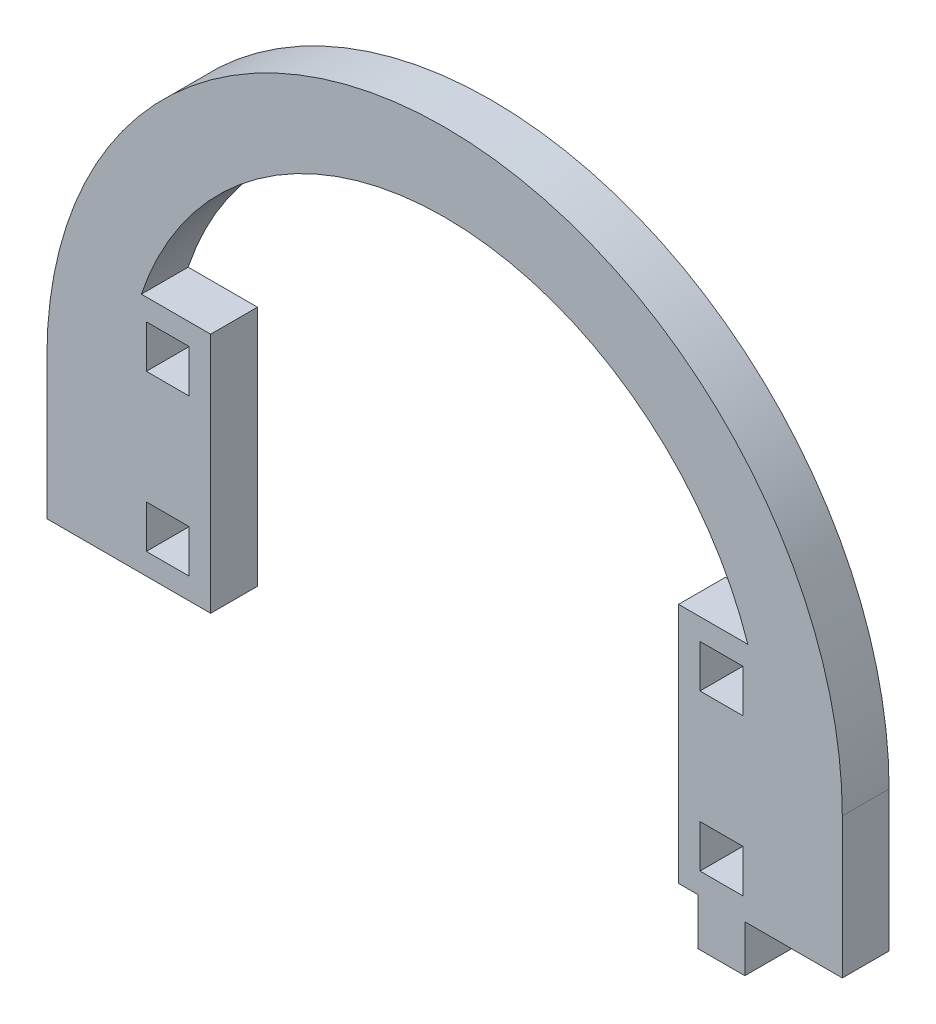
ISO-10303-21;
HEADER;
FILE_DESCRIPTION(('STEP AP214'),'2;1');
FILE_NAME('part.step','',(''),(''),'','','');
FILE_SCHEMA(('AUTOMOTIVE_DESIGN { 1 0 10303 214 1 1 1 1 }'));
ENDSEC;
DATA;
#1=APPLICATION_CONTEXT('core data for automotive mechanical design processes');
#2=APPLICATION_PROTOCOL_DEFINITION('international standard','automotive_design',2000,#1);
#3=PRODUCT_CONTEXT('',#1,'mechanical');
#4=PRODUCT('Part','Part','',(#3));
#5=PRODUCT_RELATED_PRODUCT_CATEGORY('part','',(#4));
#6=PRODUCT_DEFINITION_FORMATION('','',#4);
#7=PRODUCT_DEFINITION_CONTEXT('part definition',#1,'design');
#8=PRODUCT_DEFINITION('design','',#6,#7);
#9=PRODUCT_DEFINITION_SHAPE('','',#8);
#10=(LENGTH_UNIT() NAMED_UNIT(*) SI_UNIT(.MILLI.,.METRE.));
#11=(NAMED_UNIT(*) PLANE_ANGLE_UNIT() SI_UNIT($,.RADIAN.));
#12=(NAMED_UNIT(*) SI_UNIT($,.STERADIAN.) SOLID_ANGLE_UNIT());
#13=UNCERTAINTY_MEASURE_WITH_UNIT(LENGTH_MEASURE(1.E-05),#10,'distance_accuracy_value','');
#14=(GEOMETRIC_REPRESENTATION_CONTEXT(3) GLOBAL_UNCERTAINTY_ASSIGNED_CONTEXT((#13)) GLOBAL_UNIT_ASSIGNED_CONTEXT((#10,
#11,#12)) REPRESENTATION_CONTEXT('',''));
#15=CARTESIAN_POINT('',(0.,0.,0.));
#16=DIRECTION('',(0.,0.,1.));
#17=DIRECTION('',(1.,0.,0.));
#18=AXIS2_PLACEMENT_3D('',#15,#16,#17);
#19=CARTESIAN_POINT('',(3081.37046218599,1416.78891498135,6.));
#20=DIRECTION('',(0.,0.,1.));
#21=DIRECTION('',(1.,0.,0.));
#22=AXIS2_PLACEMENT_3D('',#19,#20,#21);
#23=PLANE('',#22);
#24=CARTESIAN_POINT('',(3081.37046218599,1416.78891498135,6.));
#25=DIRECTION('',(0.,0.,1.));
#26=DIRECTION('',(1.,0.,0.));
#27=AXIS2_PLACEMENT_3D('',#24,#25,#26);
#28=CIRCLE('',#27,50.9999999999999);
#29=CARTESIAN_POINT('',(3132.37046218599,1416.78891498135,6.));
#30=VERTEX_POINT('',#29);
#31=CARTESIAN_POINT('',(3030.37046218599,1416.78891498135,6.));
#32=VERTEX_POINT('',#31);
#33=EDGE_CURVE('E642',#30,#32,#28,.T.);
#34=ORIENTED_EDGE('',*,*,#33,.T.);
#35=DIRECTION('',(0.,-1.,0.));
#36=VECTOR('',#35,1.);
#37=CARTESIAN_POINT('',(3030.37046218599,1416.78891498135,6.));
#38=LINE('',#37,#36);
#39=CARTESIAN_POINT('',(3030.37046218599,1398.78891498135,6.));
#40=VERTEX_POINT('',#39);
#41=EDGE_CURVE('E646',#32,#40,#38,.T.);
#42=ORIENTED_EDGE('',*,*,#41,.T.);
#43=DIRECTION('',(-1.,0.,0.));
#44=VECTOR('',#43,1.);
#45=CARTESIAN_POINT('',(3040.37046218599,1398.78891498135,6.));
#46=LINE('',#45,#44);
#47=CARTESIAN_POINT('',(3051.37046218599,1398.78891498135,6.));
#48=VERTEX_POINT('',#47);
#49=EDGE_CURVE('E650',#48,#40,#46,.T.);
#50=ORIENTED_EDGE('',*,*,#49,.F.);
#51=DIRECTION('',(0.,-1.,0.));
#52=VECTOR('',#51,1.);
#53=CARTESIAN_POINT('',(3051.37046218599,1429.78891498135,6.));
#54=LINE('',#53,#52);
#55=CARTESIAN_POINT('',(3051.37046218599,1429.78891498135,6.));
#56=VERTEX_POINT('',#55);
#57=EDGE_CURVE('E654',#56,#48,#54,.T.);
#58=ORIENTED_EDGE('',*,*,#57,.F.);
#59=DIRECTION('',(-1.,0.,0.));
#60=VECTOR('',#59,1.);
#61=CARTESIAN_POINT('',(3051.37046218599,1429.78891498135,6.));
#62=LINE('',#61,#60);
#63=CARTESIAN_POINT('',(3042.48601799554,1429.78891498135,6.));
#64=VERTEX_POINT('',#63);
#65=EDGE_CURVE('E658',#56,#64,#62,.T.);
#66=ORIENTED_EDGE('',*,*,#65,.T.);
#67=CARTESIAN_POINT('',(3081.37046218599,1416.78891498135,6.));
#68=DIRECTION('',(0.,0.,1.));
#69=DIRECTION('',(1.,0.,0.));
#70=AXIS2_PLACEMENT_3D('',#67,#68,#69);
#71=CIRCLE('',#70,41.0000000000005);
#72=CARTESIAN_POINT('',(3120.25490637644,1429.78891498135,6.));
#73=VERTEX_POINT('',#72);
#74=EDGE_CURVE('E661',#73,#64,#71,.T.);
#75=ORIENTED_EDGE('',*,*,#74,.F.);
#76=DIRECTION('',(-1.,0.,0.));
#77=VECTOR('',#76,1.);
#78=CARTESIAN_POINT('',(3120.25490637644,1429.78891498135,6.));
#79=LINE('',#78,#77);
#80=CARTESIAN_POINT('',(3111.37046218599,1429.78891498135,6.));
#81=VERTEX_POINT('',#80);
#82=EDGE_CURVE('E665',#73,#81,#79,.T.);
#83=ORIENTED_EDGE('',*,*,#82,.T.);
#84=DIRECTION('',(0.,-1.,0.));
#85=VECTOR('',#84,1.);
#86=CARTESIAN_POINT('',(3111.37046218599,1429.78891498135,6.));
#87=LINE('',#86,#85);
#88=CARTESIAN_POINT('',(3111.37046218599,1398.78891498135,6.));
#89=VERTEX_POINT('',#88);
#90=EDGE_CURVE('E668',#81,#89,#87,.T.);
#91=ORIENTED_EDGE('',*,*,#90,.T.);
#92=DIRECTION('',(1.,0.,0.));
#93=VECTOR('',#92,1.);
#94=CARTESIAN_POINT('',(3111.37046218599,1398.78891498135,6.));
#95=LINE('',#94,#93);
#96=CARTESIAN_POINT('',(3113.87046218599,1398.78891498135,6.));
#97=VERTEX_POINT('',#96);
#98=EDGE_CURVE('E671',#89,#97,#95,.T.);
#99=ORIENTED_EDGE('',*,*,#98,.T.);
#100=DIRECTION('',(0.,-1.,0.));
#101=VECTOR('',#100,1.);
#102=CARTESIAN_POINT('',(3113.87046218599,1398.78891498135,6.));
#103=LINE('',#102,#101);
#104=CARTESIAN_POINT('',(3113.87046218599,1392.78891498135,6.));
#105=VERTEX_POINT('',#104);
#106=EDGE_CURVE('E674',#97,#105,#103,.T.);
#107=ORIENTED_EDGE('',*,*,#106,.T.);
#108=DIRECTION('',(1.,0.,0.));
#109=VECTOR('',#108,1.);
#110=CARTESIAN_POINT('',(3113.87046218599,1392.78891498135,6.));
#111=LINE('',#110,#109);
#112=CARTESIAN_POINT('',(3119.87046218599,1392.78891498135,6.));
#113=VERTEX_POINT('',#112);
#114=EDGE_CURVE('E677',#105,#113,#111,.T.);
#115=ORIENTED_EDGE('',*,*,#114,.T.);
#116=DIRECTION('',(0.,1.,0.));
#117=VECTOR('',#116,1.);
#118=CARTESIAN_POINT('',(3119.87046218599,1392.78891498135,6.));
#119=LINE('',#118,#117);
#120=CARTESIAN_POINT('',(3119.87046218599,1398.78891498135,6.));
#121=VERTEX_POINT('',#120);
#122=EDGE_CURVE('E680',#113,#121,#119,.T.);
#123=ORIENTED_EDGE('',*,*,#122,.T.);
#124=DIRECTION('',(1.,0.,0.));
#125=VECTOR('',#124,1.);
#126=CARTESIAN_POINT('',(3119.87046218599,1398.78891498135,6.));
#127=LINE('',#126,#125);
#128=CARTESIAN_POINT('',(3132.37046218599,1398.78891498135,6.));
#129=VERTEX_POINT('',#128);
#130=EDGE_CURVE('E683',#121,#129,#127,.T.);
#131=ORIENTED_EDGE('',*,*,#130,.T.);
#132=DIRECTION('',(0.,-1.,0.));
#133=VECTOR('',#132,1.);
#134=CARTESIAN_POINT('',(3132.37046218599,1416.78891498135,6.));
#135=LINE('',#134,#133);
#136=EDGE_CURVE('E686',#30,#129,#135,.T.);
#137=ORIENTED_EDGE('',*,*,#136,.F.);
#138=EDGE_LOOP('',(#34,#42,#50,#58,#66,#75,#83,#91,#99,#107,#115,#123,#131,#137));
#139=FACE_BOUND('',#138,.T.);
#140=DIRECTION('',(0.,1.,0.));
#141=VECTOR('',#140,1.);
#142=CARTESIAN_POINT('',(3048.62046218599,0.,6.));
#143=LINE('',#142,#141);
#144=CARTESIAN_POINT('',(3048.62046218599,1401.53891498135,6.));
#145=VERTEX_POINT('',#144);
#146=CARTESIAN_POINT('',(3048.62046218599,1407.03891498135,6.));
#147=VERTEX_POINT('',#146);
#148=EDGE_CURVE('E602',#145,#147,#143,.T.);
#149=ORIENTED_EDGE('',*,*,#148,.F.);
#150=DIRECTION('',(1.,0.,0.));
#151=VECTOR('',#150,1.);
#152=CARTESIAN_POINT('',(0.,1401.53891498135,6.));
#153=LINE('',#152,#151);
#154=CARTESIAN_POINT('',(3043.12046218599,1401.53891498135,6.));
#155=VERTEX_POINT('',#154);
#156=EDGE_CURVE('E599',#155,#145,#153,.T.);
#157=ORIENTED_EDGE('',*,*,#156,.F.);
#158=DIRECTION('',(0.,-1.,0.));
#159=VECTOR('',#158,1.);
#160=CARTESIAN_POINT('',(3043.12046218599,0.,6.));
#161=LINE('',#160,#159);
#162=CARTESIAN_POINT('',(3043.12046218599,1407.03891498135,6.));
#163=VERTEX_POINT('',#162);
#164=EDGE_CURVE('E610',#163,#155,#161,.T.);
#165=ORIENTED_EDGE('',*,*,#164,.F.);
#166=DIRECTION('',(-1.,0.,0.));
#167=VECTOR('',#166,1.);
#168=CARTESIAN_POINT('',(0.,1407.03891498135,6.));
#169=LINE('',#168,#167);
#170=EDGE_CURVE('E606',#147,#163,#169,.T.);
#171=ORIENTED_EDGE('',*,*,#170,.F.);
#172=EDGE_LOOP('',(#149,#157,#165,#171));
#173=FACE_BOUND('',#172,.T.);
#174=DIRECTION('',(0.,1.,0.));
#175=VECTOR('',#174,1.);
#176=CARTESIAN_POINT('',(3119.62046218599,0.,6.));
#177=LINE('',#176,#175);
#178=CARTESIAN_POINT('',(3119.62046218599,1421.53891498135,6.));
#179=VERTEX_POINT('',#178);
#180=CARTESIAN_POINT('',(3119.62046218599,1427.03891498135,6.));
#181=VERTEX_POINT('',#180);
#182=EDGE_CURVE('E559',#179,#181,#177,.T.);
#183=ORIENTED_EDGE('',*,*,#182,.F.);
#184=DIRECTION('',(1.,0.,0.));
#185=VECTOR('',#184,1.);
#186=CARTESIAN_POINT('',(0.,1421.53891498135,6.));
#187=LINE('',#186,#185);
#188=CARTESIAN_POINT('',(3114.12046218599,1421.53891498135,6.));
#189=VERTEX_POINT('',#188);
#190=EDGE_CURVE('E556',#189,#179,#187,.T.);
#191=ORIENTED_EDGE('',*,*,#190,.F.);
#192=DIRECTION('',(0.,-1.,0.));
#193=VECTOR('',#192,1.);
#194=CARTESIAN_POINT('',(3114.12046218599,0.,6.));
#195=LINE('',#194,#193);
#196=CARTESIAN_POINT('',(3114.12046218599,1427.03891498135,6.));
#197=VERTEX_POINT('',#196);
#198=EDGE_CURVE('E567',#197,#189,#195,.T.);
#199=ORIENTED_EDGE('',*,*,#198,.F.);
#200=DIRECTION('',(-1.,0.,0.));
#201=VECTOR('',#200,1.);
#202=CARTESIAN_POINT('',(0.,1427.03891498135,6.));
#203=LINE('',#202,#201);
#204=EDGE_CURVE('E563',#181,#197,#203,.T.);
#205=ORIENTED_EDGE('',*,*,#204,.F.);
#206=EDGE_LOOP('',(#183,#191,#199,#205));
#207=FACE_BOUND('',#206,.T.);
#208=DIRECTION('',(0.,1.,0.));
#209=VECTOR('',#208,1.);
#210=CARTESIAN_POINT('',(3119.62046218599,0.,6.));
#211=LINE('',#210,#209);
#212=CARTESIAN_POINT('',(3119.62046218599,1401.53891498135,6.));
#213=VERTEX_POINT('',#212);
#214=CARTESIAN_POINT('',(3119.62046218599,1407.03891498135,6.));
#215=VERTEX_POINT('',#214);
#216=EDGE_CURVE('E516',#213,#215,#211,.T.);
#217=ORIENTED_EDGE('',*,*,#216,.F.);
#218=DIRECTION('',(1.,0.,0.));
#219=VECTOR('',#218,1.);
#220=CARTESIAN_POINT('',(0.,1401.53891498135,6.));
#221=LINE('',#220,#219);
#222=CARTESIAN_POINT('',(3114.12046218599,1401.53891498135,6.));
#223=VERTEX_POINT('',#222);
#224=EDGE_CURVE('E513',#223,#213,#221,.T.);
#225=ORIENTED_EDGE('',*,*,#224,.F.);
#226=DIRECTION('',(0.,-1.,0.));
#227=VECTOR('',#226,1.);
#228=CARTESIAN_POINT('',(3114.12046218599,0.,6.));
#229=LINE('',#228,#227);
#230=CARTESIAN_POINT('',(3114.12046218599,1407.03891498135,6.));
#231=VERTEX_POINT('',#230);
#232=EDGE_CURVE('E524',#231,#223,#229,.T.);
#233=ORIENTED_EDGE('',*,*,#232,.F.);
#234=DIRECTION('',(-1.,0.,0.));
#235=VECTOR('',#234,1.);
#236=CARTESIAN_POINT('',(0.,1407.03891498135,6.));
#237=LINE('',#236,#235);
#238=EDGE_CURVE('E520',#215,#231,#237,.T.);
#239=ORIENTED_EDGE('',*,*,#238,.F.);
#240=EDGE_LOOP('',(#217,#225,#233,#239));
#241=FACE_BOUND('',#240,.T.);
#242=DIRECTION('',(0.,-1.,0.));
#243=VECTOR('',#242,1.);
#244=CARTESIAN_POINT('',(3043.12046218599,1427.03891498135,6.));
#245=LINE('',#244,#243);
#246=CARTESIAN_POINT('',(3043.12046218599,1427.03891498135,6.));
#247=VERTEX_POINT('',#246);
#248=CARTESIAN_POINT('',(3043.12046218599,1421.53891498135,6.));
#249=VERTEX_POINT('',#248);
#250=EDGE_CURVE('E474',#247,#249,#245,.T.);
#251=ORIENTED_EDGE('',*,*,#250,.F.);
#252=DIRECTION('',(-1.,0.,0.));
#253=VECTOR('',#252,1.);
#254=CARTESIAN_POINT('',(3048.62046218599,1427.03891498135,6.));
#255=LINE('',#254,#253);
#256=CARTESIAN_POINT('',(3048.62046218599,1427.03891498135,6.));
#257=VERTEX_POINT('',#256);
#258=EDGE_CURVE('E465',#257,#247,#255,.T.);
#259=ORIENTED_EDGE('',*,*,#258,.F.);
#260=DIRECTION('',(0.,1.,0.));
#261=VECTOR('',#260,1.);
#262=CARTESIAN_POINT('',(3048.62046218599,1421.53891498135,6.));
#263=LINE('',#262,#261);
#264=CARTESIAN_POINT('',(3048.62046218599,1421.53891498135,6.));
#265=VERTEX_POINT('',#264);
#266=EDGE_CURVE('E491',#265,#257,#263,.T.);
#267=ORIENTED_EDGE('',*,*,#266,.F.);
#268=DIRECTION('',(1.,0.,0.));
#269=VECTOR('',#268,1.);
#270=CARTESIAN_POINT('',(3043.12046218599,1421.53891498135,6.));
#271=LINE('',#270,#269);
#272=EDGE_CURVE('E487',#249,#265,#271,.T.);
#273=ORIENTED_EDGE('',*,*,#272,.F.);
#274=EDGE_LOOP('',(#251,#259,#267,#273));
#275=FACE_BOUND('',#274,.T.);
#276=ADVANCED_FACE('F267',(#139,#173,#207,#241,#275),#23,.T.);
#277=CARTESIAN_POINT('',(3081.37046218599,1416.78891498135,0.));
#278=DIRECTION('',(0.,0.,1.));
#279=DIRECTION('',(1.,0.,0.));
#280=AXIS2_PLACEMENT_3D('',#277,#278,#279);
#281=PLANE('',#280);
#282=DIRECTION('',(1.,0.,0.));
#283=VECTOR('',#282,1.);
#284=CARTESIAN_POINT('',(0.,1401.53891498135,0.));
#285=LINE('',#284,#283);
#286=CARTESIAN_POINT('',(3114.12046218599,1401.53891498135,0.));
#287=VERTEX_POINT('',#286);
#288=CARTESIAN_POINT('',(3119.62046218599,1401.53891498135,0.));
#289=VERTEX_POINT('',#288);
#290=EDGE_CURVE('E483',#287,#289,#285,.T.);
#291=ORIENTED_EDGE('',*,*,#290,.T.);
#292=DIRECTION('',(0.,1.,0.));
#293=VECTOR('',#292,1.);
#294=CARTESIAN_POINT('',(3119.62046218599,0.,0.));
#295=LINE('',#294,#293);
#296=CARTESIAN_POINT('',(3119.62046218599,1407.03891498135,0.));
#297=VERTEX_POINT('',#296);
#298=EDGE_CURVE('E531',#289,#297,#295,.T.);
#299=ORIENTED_EDGE('',*,*,#298,.T.);
#300=DIRECTION('',(-1.,0.,0.));
#301=VECTOR('',#300,1.);
#302=CARTESIAN_POINT('',(0.,1407.03891498135,0.));
#303=LINE('',#302,#301);
#304=CARTESIAN_POINT('',(3114.12046218599,1407.03891498135,0.));
#305=VERTEX_POINT('',#304);
#306=EDGE_CURVE('E535',#297,#305,#303,.T.);
#307=ORIENTED_EDGE('',*,*,#306,.T.);
#308=DIRECTION('',(0.,-1.,0.));
#309=VECTOR('',#308,1.);
#310=CARTESIAN_POINT('',(3114.12046218599,0.,0.));
#311=LINE('',#310,#309);
#312=EDGE_CURVE('E517',#305,#287,#311,.T.);
#313=ORIENTED_EDGE('',*,*,#312,.T.);
#314=EDGE_LOOP('',(#291,#299,#307,#313));
#315=FACE_BOUND('',#314,.T.);
#316=DIRECTION('',(1.,0.,0.));
#317=VECTOR('',#316,1.);
#318=CARTESIAN_POINT('',(0.,1401.53891498135,0.));
#319=LINE('',#318,#317);
#320=CARTESIAN_POINT('',(3043.12046218599,1401.53891498135,0.));
#321=VERTEX_POINT('',#320);
#322=CARTESIAN_POINT('',(3048.62046218599,1401.53891498135,0.));
#323=VERTEX_POINT('',#322);
#324=EDGE_CURVE('E598',#321,#323,#319,.T.);
#325=ORIENTED_EDGE('',*,*,#324,.T.);
#326=DIRECTION('',(0.,1.,0.));
#327=VECTOR('',#326,1.);
#328=CARTESIAN_POINT('',(3048.62046218599,0.,0.));
#329=LINE('',#328,#327);
#330=CARTESIAN_POINT('',(3048.62046218599,1407.03891498135,0.));
#331=VERTEX_POINT('',#330);
#332=EDGE_CURVE('E617',#323,#331,#329,.T.);
#333=ORIENTED_EDGE('',*,*,#332,.T.);
#334=DIRECTION('',(-1.,0.,0.));
#335=VECTOR('',#334,1.);
#336=CARTESIAN_POINT('',(0.,1407.03891498135,0.));
#337=LINE('',#336,#335);
#338=CARTESIAN_POINT('',(3043.12046218599,1407.03891498135,0.));
#339=VERTEX_POINT('',#338);
#340=EDGE_CURVE('E621',#331,#339,#337,.T.);
#341=ORIENTED_EDGE('',*,*,#340,.T.);
#342=DIRECTION('',(0.,-1.,0.));
#343=VECTOR('',#342,1.);
#344=CARTESIAN_POINT('',(3043.12046218599,0.,0.));
#345=LINE('',#344,#343);
#346=EDGE_CURVE('E603',#339,#321,#345,.T.);
#347=ORIENTED_EDGE('',*,*,#346,.T.);
#348=EDGE_LOOP('',(#325,#333,#341,#347));
#349=FACE_BOUND('',#348,.T.);
#350=CARTESIAN_POINT('',(3081.37046218599,1416.78891498135,0.));
#351=DIRECTION('',(0.,0.,1.));
#352=DIRECTION('',(1.,0.,0.));
#353=AXIS2_PLACEMENT_3D('',#350,#351,#352);
#354=CIRCLE('',#353,50.9999999999999);
#355=CARTESIAN_POINT('',(3132.37046218599,1416.78891498135,0.));
#356=VERTEX_POINT('',#355);
#357=CARTESIAN_POINT('',(3030.37046218599,1416.78891498135,0.));
#358=VERTEX_POINT('',#357);
#359=EDGE_CURVE('E641',#356,#358,#354,.T.);
#360=ORIENTED_EDGE('',*,*,#359,.F.);
#361=DIRECTION('',(0.,-1.,0.));
#362=VECTOR('',#361,1.);
#363=CARTESIAN_POINT('',(3132.37046218599,1416.78891498135,0.));
#364=LINE('',#363,#362);
#365=CARTESIAN_POINT('',(3132.37046218599,1398.78891498135,0.));
#366=VERTEX_POINT('',#365);
#367=EDGE_CURVE('E647',#356,#366,#364,.T.);
#368=ORIENTED_EDGE('',*,*,#367,.T.);
#369=DIRECTION('',(1.,0.,0.));
#370=VECTOR('',#369,1.);
#371=CARTESIAN_POINT('',(3119.87046218599,1398.78891498135,0.));
#372=LINE('',#371,#370);
#373=CARTESIAN_POINT('',(3119.87046218599,1398.78891498135,0.));
#374=VERTEX_POINT('',#373);
#375=EDGE_CURVE('E732',#374,#366,#372,.T.);
#376=ORIENTED_EDGE('',*,*,#375,.F.);
#377=DIRECTION('',(0.,1.,0.));
#378=VECTOR('',#377,1.);
#379=CARTESIAN_POINT('',(3119.87046218599,1392.78891498135,0.));
#380=LINE('',#379,#378);
#381=CARTESIAN_POINT('',(3119.87046218599,1392.78891498135,0.));
#382=VERTEX_POINT('',#381);
#383=EDGE_CURVE('E729',#382,#374,#380,.T.);
#384=ORIENTED_EDGE('',*,*,#383,.F.);
#385=DIRECTION('',(1.,0.,0.));
#386=VECTOR('',#385,1.);
#387=CARTESIAN_POINT('',(3113.87046218599,1392.78891498135,0.));
#388=LINE('',#387,#386);
#389=CARTESIAN_POINT('',(3113.87046218599,1392.78891498135,0.));
#390=VERTEX_POINT('',#389);
#391=EDGE_CURVE('E726',#390,#382,#388,.T.);
#392=ORIENTED_EDGE('',*,*,#391,.F.);
#393=DIRECTION('',(0.,-1.,0.));
#394=VECTOR('',#393,1.);
#395=CARTESIAN_POINT('',(3113.87046218599,1398.78891498135,0.));
#396=LINE('',#395,#394);
#397=CARTESIAN_POINT('',(3113.87046218599,1398.78891498135,0.));
#398=VERTEX_POINT('',#397);
#399=EDGE_CURVE('E723',#398,#390,#396,.T.);
#400=ORIENTED_EDGE('',*,*,#399,.F.);
#401=DIRECTION('',(1.,0.,0.));
#402=VECTOR('',#401,1.);
#403=CARTESIAN_POINT('',(3111.37046218599,1398.78891498135,0.));
#404=LINE('',#403,#402);
#405=CARTESIAN_POINT('',(3111.37046218599,1398.78891498135,0.));
#406=VERTEX_POINT('',#405);
#407=EDGE_CURVE('E720',#406,#398,#404,.T.);
#408=ORIENTED_EDGE('',*,*,#407,.F.);
#409=DIRECTION('',(0.,-1.,0.));
#410=VECTOR('',#409,1.);
#411=CARTESIAN_POINT('',(3111.37046218599,1429.78891498135,0.));
#412=LINE('',#411,#410);
#413=CARTESIAN_POINT('',(3111.37046218599,1429.78891498135,0.));
#414=VERTEX_POINT('',#413);
#415=EDGE_CURVE('E717',#414,#406,#412,.T.);
#416=ORIENTED_EDGE('',*,*,#415,.F.);
#417=DIRECTION('',(-1.,0.,0.));
#418=VECTOR('',#417,1.);
#419=CARTESIAN_POINT('',(3120.25490637644,1429.78891498135,0.));
#420=LINE('',#419,#418);
#421=CARTESIAN_POINT('',(3120.25490637644,1429.78891498135,0.));
#422=VERTEX_POINT('',#421);
#423=EDGE_CURVE('E714',#422,#414,#420,.T.);
#424=ORIENTED_EDGE('',*,*,#423,.F.);
#425=CARTESIAN_POINT('',(3081.37046218599,1416.78891498135,0.));
#426=DIRECTION('',(0.,0.,1.));
#427=DIRECTION('',(1.,0.,0.));
#428=AXIS2_PLACEMENT_3D('',#425,#426,#427);
#429=CIRCLE('',#428,41.0000000000005);
#430=CARTESIAN_POINT('',(3042.48601799554,1429.78891498135,0.));
#431=VERTEX_POINT('',#430);
#432=EDGE_CURVE('E710',#422,#431,#429,.T.);
#433=ORIENTED_EDGE('',*,*,#432,.T.);
#434=DIRECTION('',(-1.,0.,0.));
#435=VECTOR('',#434,1.);
#436=CARTESIAN_POINT('',(3051.37046218599,1429.78891498135,0.));
#437=LINE('',#436,#435);
#438=CARTESIAN_POINT('',(3051.37046218599,1429.78891498135,0.));
#439=VERTEX_POINT('',#438);
#440=EDGE_CURVE('E706',#439,#431,#437,.T.);
#441=ORIENTED_EDGE('',*,*,#440,.F.);
#442=DIRECTION('',(0.,-1.,0.));
#443=VECTOR('',#442,1.);
#444=CARTESIAN_POINT('',(3051.37046218599,1429.78891498135,0.));
#445=LINE('',#444,#443);
#446=CARTESIAN_POINT('',(3051.37046218599,1398.78891498135,0.));
#447=VERTEX_POINT('',#446);
#448=EDGE_CURVE('E702',#439,#447,#445,.T.);
#449=ORIENTED_EDGE('',*,*,#448,.T.);
#450=DIRECTION('',(1.,0.,0.));
#451=VECTOR('',#450,1.);
#452=CARTESIAN_POINT('',(3040.37046218599,1398.78891498135,0.));
#453=LINE('',#452,#451);
#454=CARTESIAN_POINT('',(3030.37046218599,1398.78891498135,0.));
#455=VERTEX_POINT('',#454);
#456=EDGE_CURVE('E698',#455,#447,#453,.T.);
#457=ORIENTED_EDGE('',*,*,#456,.F.);
#458=DIRECTION('',(0.,-1.,0.));
#459=VECTOR('',#458,1.);
#460=CARTESIAN_POINT('',(3030.37046218599,1416.78891498135,0.));
#461=LINE('',#460,#459);
#462=EDGE_CURVE('E694',#358,#455,#461,.T.);
#463=ORIENTED_EDGE('',*,*,#462,.F.);
#464=EDGE_LOOP('',(#360,#368,#376,#384,#392,#400,#408,#416,#424,#433,#441,#449,#457,#463));
#465=FACE_BOUND('',#464,.T.);
#466=DIRECTION('',(1.,0.,0.));
#467=VECTOR('',#466,1.);
#468=CARTESIAN_POINT('',(0.,1421.53891498135,0.));
#469=LINE('',#468,#467);
#470=CARTESIAN_POINT('',(3114.12046218599,1421.53891498135,0.));
#471=VERTEX_POINT('',#470);
#472=CARTESIAN_POINT('',(3119.62046218599,1421.53891498135,0.));
#473=VERTEX_POINT('',#472);
#474=EDGE_CURVE('E555',#471,#473,#469,.T.);
#475=ORIENTED_EDGE('',*,*,#474,.T.);
#476=DIRECTION('',(0.,1.,0.));
#477=VECTOR('',#476,1.);
#478=CARTESIAN_POINT('',(3119.62046218599,0.,0.));
#479=LINE('',#478,#477);
#480=CARTESIAN_POINT('',(3119.62046218599,1427.03891498135,0.));
#481=VERTEX_POINT('',#480);
#482=EDGE_CURVE('E574',#473,#481,#479,.T.);
#483=ORIENTED_EDGE('',*,*,#482,.T.);
#484=DIRECTION('',(-1.,0.,0.));
#485=VECTOR('',#484,1.);
#486=CARTESIAN_POINT('',(0.,1427.03891498135,0.));
#487=LINE('',#486,#485);
#488=CARTESIAN_POINT('',(3114.12046218599,1427.03891498135,0.));
#489=VERTEX_POINT('',#488);
#490=EDGE_CURVE('E578',#481,#489,#487,.T.);
#491=ORIENTED_EDGE('',*,*,#490,.T.);
#492=DIRECTION('',(0.,-1.,0.));
#493=VECTOR('',#492,1.);
#494=CARTESIAN_POINT('',(3114.12046218599,0.,0.));
#495=LINE('',#494,#493);
#496=EDGE_CURVE('E560',#489,#471,#495,.T.);
#497=ORIENTED_EDGE('',*,*,#496,.T.);
#498=EDGE_LOOP('',(#475,#483,#491,#497));
#499=FACE_BOUND('',#498,.T.);
#500=DIRECTION('',(-1.,0.,0.));
#501=VECTOR('',#500,1.);
#502=CARTESIAN_POINT('',(3048.62046218599,1427.03891498135,0.));
#503=LINE('',#502,#501);
#504=CARTESIAN_POINT('',(3048.62046218599,1427.03891498135,0.));
#505=VERTEX_POINT('',#504);
#506=CARTESIAN_POINT('',(3043.12046218599,1427.03891498135,0.));
#507=VERTEX_POINT('',#506);
#508=EDGE_CURVE('E291',#505,#507,#503,.T.);
#509=ORIENTED_EDGE('',*,*,#508,.T.);
#510=DIRECTION('',(0.,-1.,0.));
#511=VECTOR('',#510,1.);
#512=CARTESIAN_POINT('',(3043.12046218599,1427.03891498135,0.));
#513=LINE('',#512,#511);
#514=CARTESIAN_POINT('',(3043.12046218599,1421.53891498135,0.));
#515=VERTEX_POINT('',#514);
#516=EDGE_CURVE('E481',#507,#515,#513,.T.);
#517=ORIENTED_EDGE('',*,*,#516,.T.);
#518=DIRECTION('',(1.,0.,0.));
#519=VECTOR('',#518,1.);
#520=CARTESIAN_POINT('',(3043.12046218599,1421.53891498135,0.));
#521=LINE('',#520,#519);
#522=CARTESIAN_POINT('',(3048.62046218599,1421.53891498135,0.));
#523=VERTEX_POINT('',#522);
#524=EDGE_CURVE('E500',#515,#523,#521,.T.);
#525=ORIENTED_EDGE('',*,*,#524,.T.);
#526=DIRECTION('',(0.,1.,0.));
#527=VECTOR('',#526,1.);
#528=CARTESIAN_POINT('',(3048.62046218599,1421.53891498135,0.));
#529=LINE('',#528,#527);
#530=EDGE_CURVE('E475',#523,#505,#529,.T.);
#531=ORIENTED_EDGE('',*,*,#530,.T.);
#532=EDGE_LOOP('',(#509,#517,#525,#531));
#533=FACE_BOUND('',#532,.T.);
#534=ADVANCED_FACE('F790',(#315,#349,#465,#499,#533),#281,.F.);
#535=CARTESIAN_POINT('',(3081.37046218599,1416.78891498135,6.));
#536=DIRECTION('',(0.,0.,-1.));
#537=DIRECTION('',(-1.,0.,0.));
#538=AXIS2_PLACEMENT_3D('',#535,#536,#537);
#539=CYLINDRICAL_SURFACE('',#538,50.9999999999999);
#540=ORIENTED_EDGE('',*,*,#359,.T.);
#541=DIRECTION('',(0.,0.,-1.));
#542=VECTOR('',#541,1.);
#543=CARTESIAN_POINT('',(3030.37046218599,1416.78891498135,6.));
#544=LINE('',#543,#542);
#545=EDGE_CURVE('E12',#32,#358,#544,.T.);
#546=ORIENTED_EDGE('',*,*,#545,.F.);
#547=ORIENTED_EDGE('',*,*,#33,.F.);
#548=DIRECTION('',(0.,0.,-1.));
#549=VECTOR('',#548,1.);
#550=CARTESIAN_POINT('',(3132.37046218599,1416.78891498135,6.));
#551=LINE('',#550,#549);
#552=EDGE_CURVE('E690',#30,#356,#551,.T.);
#553=ORIENTED_EDGE('',*,*,#552,.T.);
#554=EDGE_LOOP('',(#540,#546,#547,#553));
#555=FACE_BOUND('',#554,.T.);
#556=ADVANCED_FACE('F269',(#555),#539,.T.);
#557=CARTESIAN_POINT('',(3030.37046218599,1416.78891498135,6.));
#558=DIRECTION('',(1.,0.,0.));
#559=DIRECTION('',(0.,0.,-1.));
#560=AXIS2_PLACEMENT_3D('',#557,#558,#559);
#561=PLANE('',#560);
#562=ORIENTED_EDGE('',*,*,#462,.T.);
#563=DIRECTION('',(0.,0.,-1.));
#564=VECTOR('',#563,1.);
#565=CARTESIAN_POINT('',(3030.37046218599,1398.78891498135,6.));
#566=LINE('',#565,#564);
#567=EDGE_CURVE('E276',#40,#455,#566,.T.);
#568=ORIENTED_EDGE('',*,*,#567,.F.);
#569=ORIENTED_EDGE('',*,*,#41,.F.);
#570=ORIENTED_EDGE('',*,*,#545,.T.);
#571=EDGE_LOOP('',(#562,#568,#569,#570));
#572=FACE_BOUND('',#571,.T.);
#573=ADVANCED_FACE('F786',(#572),#561,.F.);
#574=CARTESIAN_POINT('',(3040.37046218599,1398.78891498135,6.));
#575=DIRECTION('',(0.,1.,0.));
#576=DIRECTION('',(0.,0.,1.));
#577=AXIS2_PLACEMENT_3D('',#574,#575,#576);
#578=PLANE('',#577);
#579=ORIENTED_EDGE('',*,*,#456,.T.);
#580=DIRECTION('',(0.,0.,-1.));
#581=VECTOR('',#580,1.);
#582=CARTESIAN_POINT('',(3051.37046218599,1398.78891498135,6.));
#583=LINE('',#582,#581);
#584=EDGE_CURVE('E777',#48,#447,#583,.T.);
#585=ORIENTED_EDGE('',*,*,#584,.F.);
#586=ORIENTED_EDGE('',*,*,#49,.T.);
#587=ORIENTED_EDGE('',*,*,#567,.T.);
#588=EDGE_LOOP('',(#579,#585,#586,#587));
#589=FACE_BOUND('',#588,.T.);
#590=ADVANCED_FACE('F783',(#589),#578,.F.);
#591=CARTESIAN_POINT('',(3051.37046218599,1429.78891498135,6.));
#592=DIRECTION('',(1.,0.,0.));
#593=DIRECTION('',(0.,0.,-1.));
#594=AXIS2_PLACEMENT_3D('',#591,#592,#593);
#595=PLANE('',#594);
#596=ORIENTED_EDGE('',*,*,#448,.F.);
#597=DIRECTION('',(0.,0.,-1.));
#598=VECTOR('',#597,1.);
#599=CARTESIAN_POINT('',(3051.37046218599,1429.78891498135,6.));
#600=LINE('',#599,#598);
#601=EDGE_CURVE('E774',#56,#439,#600,.T.);
#602=ORIENTED_EDGE('',*,*,#601,.F.);
#603=ORIENTED_EDGE('',*,*,#57,.T.);
#604=ORIENTED_EDGE('',*,*,#584,.T.);
#605=EDGE_LOOP('',(#596,#602,#603,#604));
#606=FACE_BOUND('',#605,.T.);
#607=ADVANCED_FACE('F796',(#606),#595,.T.);
#608=CARTESIAN_POINT('',(3051.37046218599,1429.78891498135,6.));
#609=DIRECTION('',(0.,-1.,0.));
#610=DIRECTION('',(0.,0.,-1.));
#611=AXIS2_PLACEMENT_3D('',#608,#609,#610);
#612=PLANE('',#611);
#613=ORIENTED_EDGE('',*,*,#440,.T.);
#614=DIRECTION('',(0.,0.,-1.));
#615=VECTOR('',#614,1.);
#616=CARTESIAN_POINT('',(3042.48601799554,1429.78891498135,6.));
#617=LINE('',#616,#615);
#618=EDGE_CURVE('E771',#64,#431,#617,.T.);
#619=ORIENTED_EDGE('',*,*,#618,.F.);
#620=ORIENTED_EDGE('',*,*,#65,.F.);
#621=ORIENTED_EDGE('',*,*,#601,.T.);
#622=EDGE_LOOP('',(#613,#619,#620,#621));
#623=FACE_BOUND('',#622,.T.);
#624=ADVANCED_FACE('F846',(#623),#612,.F.);
#625=CARTESIAN_POINT('',(3081.37046218599,1416.78891498135,6.));
#626=DIRECTION('',(0.,0.,-1.));
#627=DIRECTION('',(-1.,0.,0.));
#628=AXIS2_PLACEMENT_3D('',#625,#626,#627);
#629=CYLINDRICAL_SURFACE('',#628,41.0000000000005);
#630=ORIENTED_EDGE('',*,*,#432,.F.);
#631=DIRECTION('',(0.,0.,-1.));
#632=VECTOR('',#631,1.);
#633=CARTESIAN_POINT('',(3120.25490637644,1429.78891498135,6.));
#634=LINE('',#633,#632);
#635=EDGE_CURVE('E768',#73,#422,#634,.T.);
#636=ORIENTED_EDGE('',*,*,#635,.F.);
#637=ORIENTED_EDGE('',*,*,#74,.T.);
#638=ORIENTED_EDGE('',*,*,#618,.T.);
#639=EDGE_LOOP('',(#630,#636,#637,#638));
#640=FACE_BOUND('',#639,.T.);
#641=ADVANCED_FACE('F843',(#640),#629,.F.);
#642=CARTESIAN_POINT('',(3120.25490637644,1429.78891498135,6.));
#643=DIRECTION('',(0.,-1.,0.));
#644=DIRECTION('',(0.,0.,-1.));
#645=AXIS2_PLACEMENT_3D('',#642,#643,#644);
#646=PLANE('',#645);
#647=ORIENTED_EDGE('',*,*,#423,.T.);
#648=DIRECTION('',(0.,0.,-1.));
#649=VECTOR('',#648,1.);
#650=CARTESIAN_POINT('',(3111.37046218599,1429.78891498135,6.));
#651=LINE('',#650,#649);
#652=EDGE_CURVE('E764',#81,#414,#651,.T.);
#653=ORIENTED_EDGE('',*,*,#652,.F.);
#654=ORIENTED_EDGE('',*,*,#82,.F.);
#655=ORIENTED_EDGE('',*,*,#635,.T.);
#656=EDGE_LOOP('',(#647,#653,#654,#655));
#657=FACE_BOUND('',#656,.T.);
#658=ADVANCED_FACE('F853',(#657),#646,.F.);
#659=CARTESIAN_POINT('',(3111.37046218599,1429.78891498135,6.));
#660=DIRECTION('',(1.,0.,0.));
#661=DIRECTION('',(0.,0.,-1.));
#662=AXIS2_PLACEMENT_3D('',#659,#660,#661);
#663=PLANE('',#662);
#664=ORIENTED_EDGE('',*,*,#415,.T.);
#665=DIRECTION('',(0.,0.,-1.));
#666=VECTOR('',#665,1.);
#667=CARTESIAN_POINT('',(3111.37046218599,1398.78891498135,6.));
#668=LINE('',#667,#666);
#669=EDGE_CURVE('E760',#89,#406,#668,.T.);
#670=ORIENTED_EDGE('',*,*,#669,.F.);
#671=ORIENTED_EDGE('',*,*,#90,.F.);
#672=ORIENTED_EDGE('',*,*,#652,.T.);
#673=EDGE_LOOP('',(#664,#670,#671,#672));
#674=FACE_BOUND('',#673,.T.);
#675=ADVANCED_FACE('F837',(#674),#663,.F.);
#676=CARTESIAN_POINT('',(3111.37046218599,1398.78891498135,6.));
#677=DIRECTION('',(0.,1.,0.));
#678=DIRECTION('',(0.,0.,1.));
#679=AXIS2_PLACEMENT_3D('',#676,#677,#678);
#680=PLANE('',#679);
#681=ORIENTED_EDGE('',*,*,#407,.T.);
#682=DIRECTION('',(0.,0.,-1.));
#683=VECTOR('',#682,1.);
#684=CARTESIAN_POINT('',(3113.87046218599,1398.78891498135,6.));
#685=LINE('',#684,#683);
#686=EDGE_CURVE('E756',#97,#398,#685,.T.);
#687=ORIENTED_EDGE('',*,*,#686,.F.);
#688=ORIENTED_EDGE('',*,*,#98,.F.);
#689=ORIENTED_EDGE('',*,*,#669,.T.);
#690=EDGE_LOOP('',(#681,#687,#688,#689));
#691=FACE_BOUND('',#690,.T.);
#692=ADVANCED_FACE('F833',(#691),#680,.F.);
#693=CARTESIAN_POINT('',(3113.87046218599,1398.78891498135,6.));
#694=DIRECTION('',(1.,0.,0.));
#695=DIRECTION('',(0.,0.,-1.));
#696=AXIS2_PLACEMENT_3D('',#693,#694,#695);
#697=PLANE('',#696);
#698=ORIENTED_EDGE('',*,*,#399,.T.);
#699=DIRECTION('',(0.,0.,-1.));
#700=VECTOR('',#699,1.);
#701=CARTESIAN_POINT('',(3113.87046218599,1392.78891498135,6.));
#702=LINE('',#701,#700);
#703=EDGE_CURVE('E752',#105,#390,#702,.T.);
#704=ORIENTED_EDGE('',*,*,#703,.F.);
#705=ORIENTED_EDGE('',*,*,#106,.F.);
#706=ORIENTED_EDGE('',*,*,#686,.T.);
#707=EDGE_LOOP('',(#698,#704,#705,#706));
#708=FACE_BOUND('',#707,.T.);
#709=ADVANCED_FACE('F828',(#708),#697,.F.);
#710=CARTESIAN_POINT('',(3113.87046218599,1392.78891498135,6.));
#711=DIRECTION('',(0.,1.,0.));
#712=DIRECTION('',(0.,0.,1.));
#713=AXIS2_PLACEMENT_3D('',#710,#711,#712);
#714=PLANE('',#713);
#715=ORIENTED_EDGE('',*,*,#391,.T.);
#716=DIRECTION('',(0.,0.,-1.));
#717=VECTOR('',#716,1.);
#718=CARTESIAN_POINT('',(3119.87046218599,1392.78891498135,6.));
#719=LINE('',#718,#717);
#720=EDGE_CURVE('E748',#113,#382,#719,.T.);
#721=ORIENTED_EDGE('',*,*,#720,.F.);
#722=ORIENTED_EDGE('',*,*,#114,.F.);
#723=ORIENTED_EDGE('',*,*,#703,.T.);
#724=EDGE_LOOP('',(#715,#721,#722,#723));
#725=FACE_BOUND('',#724,.T.);
#726=ADVANCED_FACE('F822',(#725),#714,.F.);
#727=CARTESIAN_POINT('',(3119.87046218599,1392.78891498135,6.));
#728=DIRECTION('',(-1.,0.,0.));
#729=DIRECTION('',(0.,0.,1.));
#730=AXIS2_PLACEMENT_3D('',#727,#728,#729);
#731=PLANE('',#730);
#732=ORIENTED_EDGE('',*,*,#383,.T.);
#733=DIRECTION('',(0.,0.,-1.));
#734=VECTOR('',#733,1.);
#735=CARTESIAN_POINT('',(3119.87046218599,1398.78891498135,6.));
#736=LINE('',#735,#734);
#737=EDGE_CURVE('E744',#121,#374,#736,.T.);
#738=ORIENTED_EDGE('',*,*,#737,.F.);
#739=ORIENTED_EDGE('',*,*,#122,.F.);
#740=ORIENTED_EDGE('',*,*,#720,.T.);
#741=EDGE_LOOP('',(#732,#738,#739,#740));
#742=FACE_BOUND('',#741,.T.);
#743=ADVANCED_FACE('F818',(#742),#731,.F.);
#744=CARTESIAN_POINT('',(3119.87046218599,1398.78891498135,6.));
#745=DIRECTION('',(0.,1.,0.));
#746=DIRECTION('',(0.,0.,1.));
#747=AXIS2_PLACEMENT_3D('',#744,#745,#746);
#748=PLANE('',#747);
#749=ORIENTED_EDGE('',*,*,#375,.T.);
#750=DIRECTION('',(0.,0.,-1.));
#751=VECTOR('',#750,1.);
#752=CARTESIAN_POINT('',(3132.37046218599,1398.78891498135,6.));
#753=LINE('',#752,#751);
#754=EDGE_CURVE('E741',#129,#366,#753,.T.);
#755=ORIENTED_EDGE('',*,*,#754,.F.);
#756=ORIENTED_EDGE('',*,*,#130,.F.);
#757=ORIENTED_EDGE('',*,*,#737,.T.);
#758=EDGE_LOOP('',(#749,#755,#756,#757));
#759=FACE_BOUND('',#758,.T.);
#760=ADVANCED_FACE('F813',(#759),#748,.F.);
#761=CARTESIAN_POINT('',(3132.37046218599,1416.78891498135,6.));
#762=DIRECTION('',(1.,0.,0.));
#763=DIRECTION('',(0.,0.,-1.));
#764=AXIS2_PLACEMENT_3D('',#761,#762,#763);
#765=PLANE('',#764);
#766=ORIENTED_EDGE('',*,*,#367,.F.);
#767=ORIENTED_EDGE('',*,*,#552,.F.);
#768=ORIENTED_EDGE('',*,*,#136,.T.);
#769=ORIENTED_EDGE('',*,*,#754,.T.);
#770=EDGE_LOOP('',(#766,#767,#768,#769));
#771=FACE_BOUND('',#770,.T.);
#772=ADVANCED_FACE('F807',(#771),#765,.T.);
#773=CARTESIAN_POINT('',(0.,1401.53891498135,6.));
#774=DIRECTION('',(0.,1.,0.));
#775=DIRECTION('',(0.,0.,1.));
#776=AXIS2_PLACEMENT_3D('',#773,#774,#775);
#777=PLANE('',#776);
#778=ORIENTED_EDGE('',*,*,#324,.F.);
#779=DIRECTION('',(0.,0.,-1.));
#780=VECTOR('',#779,1.);
#781=CARTESIAN_POINT('',(3043.12046218599,1401.53891498135,6.));
#782=LINE('',#781,#780);
#783=EDGE_CURVE('E613',#155,#321,#782,.T.);
#784=ORIENTED_EDGE('',*,*,#783,.F.);
#785=ORIENTED_EDGE('',*,*,#156,.T.);
#786=DIRECTION('',(0.,0.,-1.));
#787=VECTOR('',#786,1.);
#788=CARTESIAN_POINT('',(3048.62046218599,1401.53891498135,6.));
#789=LINE('',#788,#787);
#790=EDGE_CURVE('E637',#145,#323,#789,.T.);
#791=ORIENTED_EDGE('',*,*,#790,.T.);
#792=EDGE_LOOP('',(#778,#784,#785,#791));
#793=FACE_BOUND('',#792,.T.);
#794=ADVANCED_FACE('F864',(#793),#777,.T.);
#795=CARTESIAN_POINT('',(3048.62046218599,0.,6.));
#796=DIRECTION('',(-1.,0.,0.));
#797=DIRECTION('',(0.,0.,1.));
#798=AXIS2_PLACEMENT_3D('',#795,#796,#797);
#799=PLANE('',#798);
#800=ORIENTED_EDGE('',*,*,#332,.F.);
#801=ORIENTED_EDGE('',*,*,#790,.F.);
#802=ORIENTED_EDGE('',*,*,#148,.T.);
#803=DIRECTION('',(0.,0.,-1.));
#804=VECTOR('',#803,1.);
#805=CARTESIAN_POINT('',(3048.62046218599,1407.03891498135,6.));
#806=LINE('',#805,#804);
#807=EDGE_CURVE('E634',#147,#331,#806,.T.);
#808=ORIENTED_EDGE('',*,*,#807,.T.);
#809=EDGE_LOOP('',(#800,#801,#802,#808));
#810=FACE_BOUND('',#809,.T.);
#811=ADVANCED_FACE('F920',(#810),#799,.T.);
#812=CARTESIAN_POINT('',(0.,1407.03891498135,6.));
#813=DIRECTION('',(0.,-1.,0.));
#814=DIRECTION('',(0.,0.,-1.));
#815=AXIS2_PLACEMENT_3D('',#812,#813,#814);
#816=PLANE('',#815);
#817=ORIENTED_EDGE('',*,*,#340,.F.);
#818=ORIENTED_EDGE('',*,*,#807,.F.);
#819=ORIENTED_EDGE('',*,*,#170,.T.);
#820=DIRECTION('',(0.,0.,-1.));
#821=VECTOR('',#820,1.);
#822=CARTESIAN_POINT('',(3043.12046218599,1407.03891498135,6.));
#823=LINE('',#822,#821);
#824=EDGE_CURVE('E631',#163,#339,#823,.T.);
#825=ORIENTED_EDGE('',*,*,#824,.T.);
#826=EDGE_LOOP('',(#817,#818,#819,#825));
#827=FACE_BOUND('',#826,.T.);
#828=ADVANCED_FACE('F927',(#827),#816,.T.);
#829=CARTESIAN_POINT('',(3043.12046218599,0.,6.));
#830=DIRECTION('',(1.,0.,0.));
#831=DIRECTION('',(0.,0.,-1.));
#832=AXIS2_PLACEMENT_3D('',#829,#830,#831);
#833=PLANE('',#832);
#834=ORIENTED_EDGE('',*,*,#346,.F.);
#835=ORIENTED_EDGE('',*,*,#824,.F.);
#836=ORIENTED_EDGE('',*,*,#164,.T.);
#837=ORIENTED_EDGE('',*,*,#783,.T.);
#838=EDGE_LOOP('',(#834,#835,#836,#837));
#839=FACE_BOUND('',#838,.T.);
#840=ADVANCED_FACE('F934',(#839),#833,.T.);
#841=CARTESIAN_POINT('',(0.,1421.53891498135,6.));
#842=DIRECTION('',(0.,1.,0.));
#843=DIRECTION('',(0.,0.,1.));
#844=AXIS2_PLACEMENT_3D('',#841,#842,#843);
#845=PLANE('',#844);
#846=ORIENTED_EDGE('',*,*,#474,.F.);
#847=DIRECTION('',(0.,0.,-1.));
#848=VECTOR('',#847,1.);
#849=CARTESIAN_POINT('',(3114.12046218599,1421.53891498135,6.));
#850=LINE('',#849,#848);
#851=EDGE_CURVE('E570',#189,#471,#850,.T.);
#852=ORIENTED_EDGE('',*,*,#851,.F.);
#853=ORIENTED_EDGE('',*,*,#190,.T.);
#854=DIRECTION('',(0.,0.,-1.));
#855=VECTOR('',#854,1.);
#856=CARTESIAN_POINT('',(3119.62046218599,1421.53891498135,6.));
#857=LINE('',#856,#855);
#858=EDGE_CURVE('E594',#179,#473,#857,.T.);
#859=ORIENTED_EDGE('',*,*,#858,.T.);
#860=EDGE_LOOP('',(#846,#852,#853,#859));
#861=FACE_BOUND('',#860,.T.);
#862=ADVANCED_FACE('F942',(#861),#845,.T.);
#863=CARTESIAN_POINT('',(3119.62046218599,0.,6.));
#864=DIRECTION('',(-1.,0.,0.));
#865=DIRECTION('',(0.,0.,1.));
#866=AXIS2_PLACEMENT_3D('',#863,#864,#865);
#867=PLANE('',#866);
#868=ORIENTED_EDGE('',*,*,#482,.F.);
#869=ORIENTED_EDGE('',*,*,#858,.F.);
#870=ORIENTED_EDGE('',*,*,#182,.T.);
#871=DIRECTION('',(0.,0.,-1.));
#872=VECTOR('',#871,1.);
#873=CARTESIAN_POINT('',(3119.62046218599,1427.03891498135,6.));
#874=LINE('',#873,#872);
#875=EDGE_CURVE('E591',#181,#481,#874,.T.);
#876=ORIENTED_EDGE('',*,*,#875,.T.);
#877=EDGE_LOOP('',(#868,#869,#870,#876));
#878=FACE_BOUND('',#877,.T.);
#879=ADVANCED_FACE('F950',(#878),#867,.T.);
#880=CARTESIAN_POINT('',(0.,1427.03891498135,6.));
#881=DIRECTION('',(0.,-1.,0.));
#882=DIRECTION('',(0.,0.,-1.));
#883=AXIS2_PLACEMENT_3D('',#880,#881,#882);
#884=PLANE('',#883);
#885=ORIENTED_EDGE('',*,*,#490,.F.);
#886=ORIENTED_EDGE('',*,*,#875,.F.);
#887=ORIENTED_EDGE('',*,*,#204,.T.);
#888=DIRECTION('',(0.,0.,-1.));
#889=VECTOR('',#888,1.);
#890=CARTESIAN_POINT('',(3114.12046218599,1427.03891498135,6.));
#891=LINE('',#890,#889);
#892=EDGE_CURVE('E588',#197,#489,#891,.T.);
#893=ORIENTED_EDGE('',*,*,#892,.T.);
#894=EDGE_LOOP('',(#885,#886,#887,#893));
#895=FACE_BOUND('',#894,.T.);
#896=ADVANCED_FACE('F958',(#895),#884,.T.);
#897=CARTESIAN_POINT('',(3114.12046218599,0.,6.));
#898=DIRECTION('',(1.,0.,0.));
#899=DIRECTION('',(0.,0.,-1.));
#900=AXIS2_PLACEMENT_3D('',#897,#898,#899);
#901=PLANE('',#900);
#902=ORIENTED_EDGE('',*,*,#496,.F.);
#903=ORIENTED_EDGE('',*,*,#892,.F.);
#904=ORIENTED_EDGE('',*,*,#198,.T.);
#905=ORIENTED_EDGE('',*,*,#851,.T.);
#906=EDGE_LOOP('',(#902,#903,#904,#905));
#907=FACE_BOUND('',#906,.T.);
#908=ADVANCED_FACE('F966',(#907),#901,.T.);
#909=CARTESIAN_POINT('',(0.,1401.53891498135,6.));
#910=DIRECTION('',(0.,1.,0.));
#911=DIRECTION('',(0.,0.,1.));
#912=AXIS2_PLACEMENT_3D('',#909,#910,#911);
#913=PLANE('',#912);
#914=ORIENTED_EDGE('',*,*,#290,.F.);
#915=DIRECTION('',(0.,0.,-1.));
#916=VECTOR('',#915,1.);
#917=CARTESIAN_POINT('',(3114.12046218599,1401.53891498135,6.));
#918=LINE('',#917,#916);
#919=EDGE_CURVE('E527',#223,#287,#918,.T.);
#920=ORIENTED_EDGE('',*,*,#919,.F.);
#921=ORIENTED_EDGE('',*,*,#224,.T.);
#922=DIRECTION('',(0.,0.,-1.));
#923=VECTOR('',#922,1.);
#924=CARTESIAN_POINT('',(3119.62046218599,1401.53891498135,6.));
#925=LINE('',#924,#923);
#926=EDGE_CURVE('E551',#213,#289,#925,.T.);
#927=ORIENTED_EDGE('',*,*,#926,.T.);
#928=EDGE_LOOP('',(#914,#920,#921,#927));
#929=FACE_BOUND('',#928,.T.);
#930=ADVANCED_FACE('F974',(#929),#913,.T.);
#931=CARTESIAN_POINT('',(3119.62046218599,0.,6.));
#932=DIRECTION('',(-1.,0.,0.));
#933=DIRECTION('',(0.,0.,1.));
#934=AXIS2_PLACEMENT_3D('',#931,#932,#933);
#935=PLANE('',#934);
#936=ORIENTED_EDGE('',*,*,#298,.F.);
#937=ORIENTED_EDGE('',*,*,#926,.F.);
#938=ORIENTED_EDGE('',*,*,#216,.T.);
#939=DIRECTION('',(0.,0.,-1.));
#940=VECTOR('',#939,1.);
#941=CARTESIAN_POINT('',(3119.62046218599,1407.03891498135,6.));
#942=LINE('',#941,#940);
#943=EDGE_CURVE('E548',#215,#297,#942,.T.);
#944=ORIENTED_EDGE('',*,*,#943,.T.);
#945=EDGE_LOOP('',(#936,#937,#938,#944));
#946=FACE_BOUND('',#945,.T.);
#947=ADVANCED_FACE('F982',(#946),#935,.T.);
#948=CARTESIAN_POINT('',(0.,1407.03891498135,6.));
#949=DIRECTION('',(0.,-1.,0.));
#950=DIRECTION('',(0.,0.,-1.));
#951=AXIS2_PLACEMENT_3D('',#948,#949,#950);
#952=PLANE('',#951);
#953=ORIENTED_EDGE('',*,*,#306,.F.);
#954=ORIENTED_EDGE('',*,*,#943,.F.);
#955=ORIENTED_EDGE('',*,*,#238,.T.);
#956=DIRECTION('',(0.,0.,-1.));
#957=VECTOR('',#956,1.);
#958=CARTESIAN_POINT('',(3114.12046218599,1407.03891498135,6.));
#959=LINE('',#958,#957);
#960=EDGE_CURVE('E545',#231,#305,#959,.T.);
#961=ORIENTED_EDGE('',*,*,#960,.T.);
#962=EDGE_LOOP('',(#953,#954,#955,#961));
#963=FACE_BOUND('',#962,.T.);
#964=ADVANCED_FACE('F990',(#963),#952,.T.);
#965=CARTESIAN_POINT('',(3114.12046218599,0.,6.));
#966=DIRECTION('',(1.,0.,0.));
#967=DIRECTION('',(0.,0.,-1.));
#968=AXIS2_PLACEMENT_3D('',#965,#966,#967);
#969=PLANE('',#968);
#970=ORIENTED_EDGE('',*,*,#312,.F.);
#971=ORIENTED_EDGE('',*,*,#960,.F.);
#972=ORIENTED_EDGE('',*,*,#232,.T.);
#973=ORIENTED_EDGE('',*,*,#919,.T.);
#974=EDGE_LOOP('',(#970,#971,#972,#973));
#975=FACE_BOUND('',#974,.T.);
#976=ADVANCED_FACE('F998',(#975),#969,.T.);
#977=CARTESIAN_POINT('',(3048.62046218599,1427.03891498135,6.));
#978=DIRECTION('',(0.,-1.,0.));
#979=DIRECTION('',(0.,0.,-1.));
#980=AXIS2_PLACEMENT_3D('',#977,#978,#979);
#981=PLANE('',#980);
#982=ORIENTED_EDGE('',*,*,#508,.F.);
#983=DIRECTION('',(0.,0.,-1.));
#984=VECTOR('',#983,1.);
#985=CARTESIAN_POINT('',(3048.62046218599,1427.03891498135,6.));
#986=LINE('',#985,#984);
#987=EDGE_CURVE('E469',#257,#505,#986,.T.);
#988=ORIENTED_EDGE('',*,*,#987,.F.);
#989=ORIENTED_EDGE('',*,*,#258,.T.);
#990=DIRECTION('',(0.,0.,-1.));
#991=VECTOR('',#990,1.);
#992=CARTESIAN_POINT('',(3043.12046218599,1427.03891498135,6.));
#993=LINE('',#992,#991);
#994=EDGE_CURVE('E468',#247,#507,#993,.T.);
#995=ORIENTED_EDGE('',*,*,#994,.T.);
#996=EDGE_LOOP('',(#982,#988,#989,#995));
#997=FACE_BOUND('',#996,.T.);
#998=ADVANCED_FACE('F467',(#997),#981,.T.);
#999=CARTESIAN_POINT('',(3043.12046218599,1427.03891498135,6.));
#1000=DIRECTION('',(1.,0.,0.));
#1001=DIRECTION('',(0.,0.,-1.));
#1002=AXIS2_PLACEMENT_3D('',#999,#1000,#1001);
#1003=PLANE('',#1002);
#1004=ORIENTED_EDGE('',*,*,#516,.F.);
#1005=ORIENTED_EDGE('',*,*,#994,.F.);
#1006=ORIENTED_EDGE('',*,*,#250,.T.);
#1007=DIRECTION('',(0.,0.,-1.));
#1008=VECTOR('',#1007,1.);
#1009=CARTESIAN_POINT('',(3043.12046218599,1421.53891498135,6.));
#1010=LINE('',#1009,#1008);
#1011=EDGE_CURVE('E484',#249,#515,#1010,.T.);
#1012=ORIENTED_EDGE('',*,*,#1011,.T.);
#1013=EDGE_LOOP('',(#1004,#1005,#1006,#1012));
#1014=FACE_BOUND('',#1013,.T.);
#1015=ADVANCED_FACE('F478',(#1014),#1003,.T.);
#1016=CARTESIAN_POINT('',(3043.12046218599,1421.53891498135,6.));
#1017=DIRECTION('',(0.,1.,0.));
#1018=DIRECTION('',(0.,0.,1.));
#1019=AXIS2_PLACEMENT_3D('',#1016,#1017,#1018);
#1020=PLANE('',#1019);
#1021=ORIENTED_EDGE('',*,*,#524,.F.);
#1022=ORIENTED_EDGE('',*,*,#1011,.F.);
#1023=ORIENTED_EDGE('',*,*,#272,.T.);
#1024=DIRECTION('',(0.,0.,-1.));
#1025=VECTOR('',#1024,1.);
#1026=CARTESIAN_POINT('',(3048.62046218599,1421.53891498135,6.));
#1027=LINE('',#1026,#1025);
#1028=EDGE_CURVE('E283',#265,#523,#1027,.T.);
#1029=ORIENTED_EDGE('',*,*,#1028,.T.);
#1030=EDGE_LOOP('',(#1021,#1022,#1023,#1029));
#1031=FACE_BOUND('',#1030,.T.);
#1032=ADVANCED_FACE('F1019',(#1031),#1020,.T.);
#1033=CARTESIAN_POINT('',(3048.62046218599,1421.53891498135,6.));
#1034=DIRECTION('',(-1.,0.,0.));
#1035=DIRECTION('',(0.,0.,1.));
#1036=AXIS2_PLACEMENT_3D('',#1033,#1034,#1035);
#1037=PLANE('',#1036);
#1038=ORIENTED_EDGE('',*,*,#530,.F.);
#1039=ORIENTED_EDGE('',*,*,#1028,.F.);
#1040=ORIENTED_EDGE('',*,*,#266,.T.);
#1041=ORIENTED_EDGE('',*,*,#987,.T.);
#1042=EDGE_LOOP('',(#1038,#1039,#1040,#1041));
#1043=FACE_BOUND('',#1042,.T.);
#1044=ADVANCED_FACE('F1026',(#1043),#1037,.T.);
#1045=CLOSED_SHELL('',(#276,#534,#556,#573,#590,#607,#624,#641,#658,#675,#692,#709,#726,#743,
#760,#772,#794,#811,#828,#840,#862,#879,#896,#908,#930,#947,#964,#976,#998,#1015,#1032,#1044));
#1046=MANIFOLD_SOLID_BREP('B2',#1045);
#1047=ADVANCED_BREP_SHAPE_REPRESENTATION('',(#18,#1046),#14);
#1048=SHAPE_DEFINITION_REPRESENTATION(#9,#1047);
ENDSEC;
END-ISO-10303-21;
